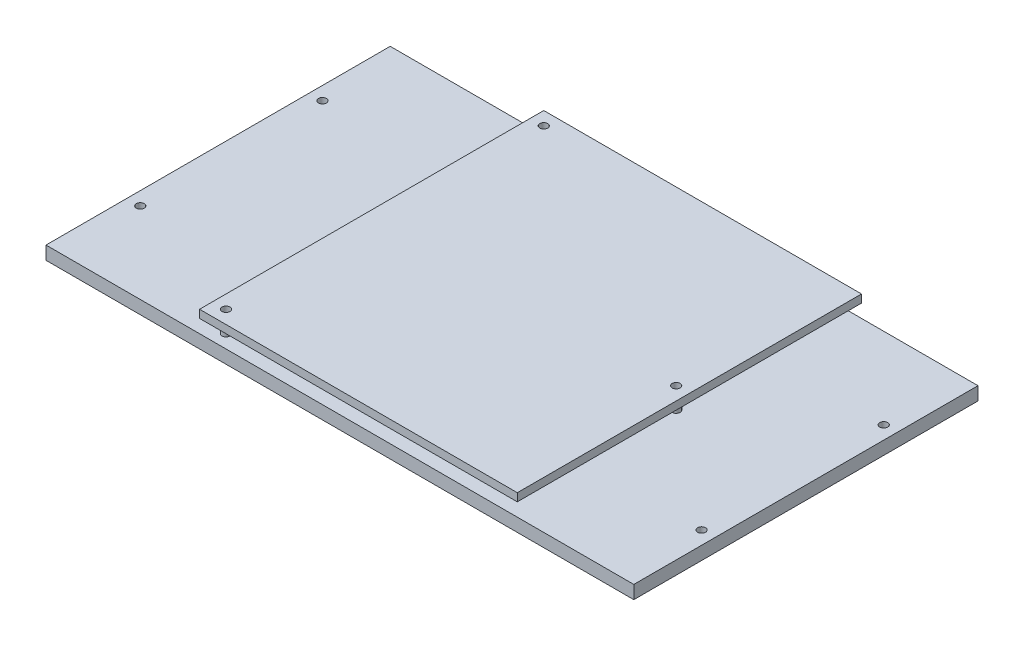
ISO-10303-21;
HEADER;
FILE_DESCRIPTION(('STEP AP214'),'2;1');
FILE_NAME('part.step','',(''),(''),'','','');
FILE_SCHEMA(('AUTOMOTIVE_DESIGN { 1 0 10303 214 1 1 1 1 }'));
ENDSEC;
DATA;
#1=APPLICATION_CONTEXT('core data for automotive mechanical design processes');
#2=APPLICATION_PROTOCOL_DEFINITION('international standard','automotive_design',2000,#1);
#3=PRODUCT_CONTEXT('',#1,'mechanical');
#4=PRODUCT('Part','Part','',(#3));
#5=PRODUCT_RELATED_PRODUCT_CATEGORY('part','',(#4));
#6=PRODUCT_DEFINITION_FORMATION('','',#4);
#7=PRODUCT_DEFINITION_CONTEXT('part definition',#1,'design');
#8=PRODUCT_DEFINITION('design','',#6,#7);
#9=PRODUCT_DEFINITION_SHAPE('','',#8);
#10=(LENGTH_UNIT() NAMED_UNIT(*) SI_UNIT(.MILLI.,.METRE.));
#11=(NAMED_UNIT(*) PLANE_ANGLE_UNIT() SI_UNIT($,.RADIAN.));
#12=(NAMED_UNIT(*) SI_UNIT($,.STERADIAN.) SOLID_ANGLE_UNIT());
#13=UNCERTAINTY_MEASURE_WITH_UNIT(LENGTH_MEASURE(1.E-05),#10,'distance_accuracy_value','');
#14=(GEOMETRIC_REPRESENTATION_CONTEXT(3) GLOBAL_UNCERTAINTY_ASSIGNED_CONTEXT((#13)) GLOBAL_UNIT_ASSIGNED_CONTEXT((#10,
#11,#12)) REPRESENTATION_CONTEXT('',''));
#15=CARTESIAN_POINT('',(0.,0.,0.));
#16=DIRECTION('',(0.,0.,1.));
#17=DIRECTION('',(1.,0.,0.));
#18=AXIS2_PLACEMENT_3D('',#15,#16,#17);
#19=CARTESIAN_POINT('',(-53.,13.,65.));
#20=DIRECTION('',(0.,1.,0.));
#21=DIRECTION('',(0.,0.,1.));
#22=AXIS2_PLACEMENT_3D('',#19,#20,#21);
#23=PLANE('',#22);
#24=CARTESIAN_POINT('',(62.,13.,0.));
#25=DIRECTION('',(0.,1.,0.));
#26=DIRECTION('',(0.,0.,1.));
#27=AXIS2_PLACEMENT_3D('',#24,#25,#26);
#28=CIRCLE('',#27,1.5);
#29=CARTESIAN_POINT('',(62.,13.,1.5));
#30=VERTEX_POINT('',#29);
#31=EDGE_CURVE('E124',#30,#30,#28,.T.);
#32=ORIENTED_EDGE('',*,*,#31,.F.);
#33=EDGE_LOOP('',(#32));
#34=FACE_BOUND('',#33,.T.);
#35=DIRECTION('',(0.,0.,1.));
#36=VECTOR('',#35,1.);
#37=CARTESIAN_POINT('',(-53.,13.,-65.));
#38=LINE('',#37,#36);
#39=CARTESIAN_POINT('',(-53.,13.,-65.));
#40=VERTEX_POINT('',#39);
#41=CARTESIAN_POINT('',(-53.,13.,65.));
#42=VERTEX_POINT('',#41);
#43=EDGE_CURVE('E94',#40,#42,#38,.T.);
#44=ORIENTED_EDGE('',*,*,#43,.T.);
#45=DIRECTION('',(1.,0.,0.));
#46=VECTOR('',#45,1.);
#47=CARTESIAN_POINT('',(-53.,13.,65.));
#48=LINE('',#47,#46);
#49=CARTESIAN_POINT('',(67.,13.,65.));
#50=VERTEX_POINT('',#49);
#51=EDGE_CURVE('E89',#42,#50,#48,.T.);
#52=ORIENTED_EDGE('',*,*,#51,.T.);
#53=DIRECTION('',(0.,0.,-1.));
#54=VECTOR('',#53,1.);
#55=CARTESIAN_POINT('',(67.,13.,-65.));
#56=LINE('',#55,#54);
#57=CARTESIAN_POINT('',(67.,13.,-65.));
#58=VERTEX_POINT('',#57);
#59=EDGE_CURVE('E92',#50,#58,#56,.T.);
#60=ORIENTED_EDGE('',*,*,#59,.T.);
#61=DIRECTION('',(-1.,0.,0.));
#62=VECTOR('',#61,1.);
#63=CARTESIAN_POINT('',(-53.,13.,-65.));
#64=LINE('',#63,#62);
#65=EDGE_CURVE('E59',#58,#40,#64,.T.);
#66=ORIENTED_EDGE('',*,*,#65,.T.);
#67=EDGE_LOOP('',(#44,#52,#60,#66));
#68=FACE_BOUND('',#67,.T.);
#69=CARTESIAN_POINT('',(-48.,13.,60.));
#70=DIRECTION('',(0.,1.,0.));
#71=DIRECTION('',(0.,0.,1.));
#72=AXIS2_PLACEMENT_3D('',#69,#70,#71);
#73=CIRCLE('',#72,1.5);
#74=CARTESIAN_POINT('',(-48.,13.,61.5));
#75=VERTEX_POINT('',#74);
#76=EDGE_CURVE('E109',#75,#75,#73,.T.);
#77=ORIENTED_EDGE('',*,*,#76,.F.);
#78=EDGE_LOOP('',(#77));
#79=FACE_BOUND('',#78,.T.);
#80=CARTESIAN_POINT('',(-48.,13.,-60.));
#81=DIRECTION('',(0.,1.,0.));
#82=DIRECTION('',(0.,0.,1.));
#83=AXIS2_PLACEMENT_3D('',#80,#81,#82);
#84=CIRCLE('',#83,1.5);
#85=CARTESIAN_POINT('',(-48.,13.,-58.5));
#86=VERTEX_POINT('',#85);
#87=EDGE_CURVE('E130',#86,#86,#84,.T.);
#88=ORIENTED_EDGE('',*,*,#87,.F.);
#89=EDGE_LOOP('',(#88));
#90=FACE_BOUND('',#89,.T.);
#91=ADVANCED_FACE('F42',(#34,#68,#79,#90),#23,.T.);
#92=CARTESIAN_POINT('',(-53.,10.,65.));
#93=DIRECTION('',(0.,1.,0.));
#94=DIRECTION('',(0.,0.,1.));
#95=AXIS2_PLACEMENT_3D('',#92,#93,#94);
#96=PLANE('',#95);
#97=CARTESIAN_POINT('',(62.,10.,0.));
#98=DIRECTION('',(0.,1.,0.));
#99=DIRECTION('',(0.,0.,1.));
#100=AXIS2_PLACEMENT_3D('',#97,#98,#99);
#101=CIRCLE('',#100,1.5);
#102=CARTESIAN_POINT('',(62.,10.,1.5));
#103=VERTEX_POINT('',#102);
#104=EDGE_CURVE('E127',#103,#103,#101,.T.);
#105=ORIENTED_EDGE('',*,*,#104,.T.);
#106=EDGE_LOOP('',(#105));
#107=FACE_BOUND('',#106,.T.);
#108=DIRECTION('',(0.,0.,1.));
#109=VECTOR('',#108,1.);
#110=CARTESIAN_POINT('',(-53.,10.,-65.));
#111=LINE('',#110,#109);
#112=CARTESIAN_POINT('',(-53.,10.,-65.));
#113=VERTEX_POINT('',#112);
#114=CARTESIAN_POINT('',(-53.,10.,65.));
#115=VERTEX_POINT('',#114);
#116=EDGE_CURVE('E106',#113,#115,#111,.T.);
#117=ORIENTED_EDGE('',*,*,#116,.F.);
#118=DIRECTION('',(-1.,0.,0.));
#119=VECTOR('',#118,1.);
#120=CARTESIAN_POINT('',(-53.,10.,-65.));
#121=LINE('',#120,#119);
#122=CARTESIAN_POINT('',(67.,10.,-65.));
#123=VERTEX_POINT('',#122);
#124=EDGE_CURVE('E82',#123,#113,#121,.T.);
#125=ORIENTED_EDGE('',*,*,#124,.F.);
#126=DIRECTION('',(0.,0.,-1.));
#127=VECTOR('',#126,1.);
#128=CARTESIAN_POINT('',(67.,10.,-65.));
#129=LINE('',#128,#127);
#130=CARTESIAN_POINT('',(67.,10.,65.));
#131=VERTEX_POINT('',#130);
#132=EDGE_CURVE('E76',#131,#123,#129,.T.);
#133=ORIENTED_EDGE('',*,*,#132,.F.);
#134=DIRECTION('',(1.,0.,0.));
#135=VECTOR('',#134,1.);
#136=CARTESIAN_POINT('',(-53.,10.,65.));
#137=LINE('',#136,#135);
#138=EDGE_CURVE('E98',#115,#131,#137,.T.);
#139=ORIENTED_EDGE('',*,*,#138,.F.);
#140=EDGE_LOOP('',(#117,#125,#133,#139));
#141=FACE_BOUND('',#140,.T.);
#142=CARTESIAN_POINT('',(-48.,10.,60.));
#143=DIRECTION('',(0.,1.,0.));
#144=DIRECTION('',(0.,0.,1.));
#145=AXIS2_PLACEMENT_3D('',#142,#143,#144);
#146=CIRCLE('',#145,1.5);
#147=CARTESIAN_POINT('',(-48.,10.,61.5));
#148=VERTEX_POINT('',#147);
#149=EDGE_CURVE('E121',#148,#148,#146,.T.);
#150=ORIENTED_EDGE('',*,*,#149,.T.);
#151=EDGE_LOOP('',(#150));
#152=FACE_BOUND('',#151,.T.);
#153=CARTESIAN_POINT('',(-48.,10.,-60.));
#154=DIRECTION('',(0.,1.,0.));
#155=DIRECTION('',(0.,0.,1.));
#156=AXIS2_PLACEMENT_3D('',#153,#154,#155);
#157=CIRCLE('',#156,1.5);
#158=CARTESIAN_POINT('',(-48.,10.,-58.5));
#159=VERTEX_POINT('',#158);
#160=EDGE_CURVE('E133',#159,#159,#157,.T.);
#161=ORIENTED_EDGE('',*,*,#160,.T.);
#162=EDGE_LOOP('',(#161));
#163=FACE_BOUND('',#162,.T.);
#164=ADVANCED_FACE('F117',(#107,#141,#152,#163),#96,.F.);
#165=CARTESIAN_POINT('',(-53.,13.,-65.));
#166=DIRECTION('',(1.,0.,0.));
#167=DIRECTION('',(0.,0.,-1.));
#168=AXIS2_PLACEMENT_3D('',#165,#166,#167);
#169=PLANE('',#168);
#170=ORIENTED_EDGE('',*,*,#116,.T.);
#171=DIRECTION('',(0.,-1.,0.));
#172=VECTOR('',#171,1.);
#173=CARTESIAN_POINT('',(-53.,13.,65.));
#174=LINE('',#173,#172);
#175=EDGE_CURVE('E12',#42,#115,#174,.T.);
#176=ORIENTED_EDGE('',*,*,#175,.F.);
#177=ORIENTED_EDGE('',*,*,#43,.F.);
#178=DIRECTION('',(0.,-1.,0.));
#179=VECTOR('',#178,1.);
#180=CARTESIAN_POINT('',(-53.,13.,-65.));
#181=LINE('',#180,#179);
#182=EDGE_CURVE('E102',#40,#113,#181,.T.);
#183=ORIENTED_EDGE('',*,*,#182,.T.);
#184=EDGE_LOOP('',(#170,#176,#177,#183));
#185=FACE_BOUND('',#184,.T.);
#186=ADVANCED_FACE('F44',(#185),#169,.F.);
#187=CARTESIAN_POINT('',(-53.,13.,65.));
#188=DIRECTION('',(0.,0.,-1.));
#189=DIRECTION('',(-1.,0.,0.));
#190=AXIS2_PLACEMENT_3D('',#187,#188,#189);
#191=PLANE('',#190);
#192=ORIENTED_EDGE('',*,*,#138,.T.);
#193=DIRECTION('',(0.,-1.,0.));
#194=VECTOR('',#193,1.);
#195=CARTESIAN_POINT('',(67.,13.,65.));
#196=LINE('',#195,#194);
#197=EDGE_CURVE('E51',#50,#131,#196,.T.);
#198=ORIENTED_EDGE('',*,*,#197,.F.);
#199=ORIENTED_EDGE('',*,*,#51,.F.);
#200=ORIENTED_EDGE('',*,*,#175,.T.);
#201=EDGE_LOOP('',(#192,#198,#199,#200));
#202=FACE_BOUND('',#201,.T.);
#203=ADVANCED_FACE('F97',(#202),#191,.F.);
#204=CARTESIAN_POINT('',(67.,13.,-65.));
#205=DIRECTION('',(-1.,0.,0.));
#206=DIRECTION('',(0.,0.,1.));
#207=AXIS2_PLACEMENT_3D('',#204,#205,#206);
#208=PLANE('',#207);
#209=ORIENTED_EDGE('',*,*,#132,.T.);
#210=DIRECTION('',(0.,-1.,0.));
#211=VECTOR('',#210,1.);
#212=CARTESIAN_POINT('',(67.,13.,-65.));
#213=LINE('',#212,#211);
#214=EDGE_CURVE('E99',#58,#123,#213,.T.);
#215=ORIENTED_EDGE('',*,*,#214,.F.);
#216=ORIENTED_EDGE('',*,*,#59,.F.);
#217=ORIENTED_EDGE('',*,*,#197,.T.);
#218=EDGE_LOOP('',(#209,#215,#216,#217));
#219=FACE_BOUND('',#218,.T.);
#220=ADVANCED_FACE('F100',(#219),#208,.F.);
#221=CARTESIAN_POINT('',(-53.,13.,-65.));
#222=DIRECTION('',(0.,0.,1.));
#223=DIRECTION('',(1.,0.,0.));
#224=AXIS2_PLACEMENT_3D('',#221,#222,#223);
#225=PLANE('',#224);
#226=ORIENTED_EDGE('',*,*,#124,.T.);
#227=ORIENTED_EDGE('',*,*,#182,.F.);
#228=ORIENTED_EDGE('',*,*,#65,.F.);
#229=ORIENTED_EDGE('',*,*,#214,.T.);
#230=EDGE_LOOP('',(#226,#227,#228,#229));
#231=FACE_BOUND('',#230,.T.);
#232=ADVANCED_FACE('F114',(#231),#225,.F.);
#233=CARTESIAN_POINT('',(-48.,13.,60.));
#234=DIRECTION('',(0.,-1.,0.));
#235=DIRECTION('',(0.,0.,-1.));
#236=AXIS2_PLACEMENT_3D('',#233,#234,#235);
#237=CYLINDRICAL_SURFACE('',#236,1.5);
#238=ORIENTED_EDGE('',*,*,#76,.T.);
#239=EDGE_LOOP('',(#238));
#240=FACE_BOUND('',#239,.T.);
#241=ORIENTED_EDGE('',*,*,#149,.F.);
#242=EDGE_LOOP('',(#241));
#243=FACE_BOUND('',#242,.T.);
#244=ADVANCED_FACE('F152',(#240,#243),#237,.F.);
#245=CARTESIAN_POINT('',(62.,13.,0.));
#246=DIRECTION('',(0.,-1.,0.));
#247=DIRECTION('',(0.,0.,-1.));
#248=AXIS2_PLACEMENT_3D('',#245,#246,#247);
#249=CYLINDRICAL_SURFACE('',#248,1.5);
#250=ORIENTED_EDGE('',*,*,#31,.T.);
#251=EDGE_LOOP('',(#250));
#252=FACE_BOUND('',#251,.T.);
#253=ORIENTED_EDGE('',*,*,#104,.F.);
#254=EDGE_LOOP('',(#253));
#255=FACE_BOUND('',#254,.T.);
#256=ADVANCED_FACE('F200',(#252,#255),#249,.F.);
#257=CARTESIAN_POINT('',(-48.,13.,-60.));
#258=DIRECTION('',(0.,-1.,0.));
#259=DIRECTION('',(0.,0.,-1.));
#260=AXIS2_PLACEMENT_3D('',#257,#258,#259);
#261=CYLINDRICAL_SURFACE('',#260,1.5);
#262=ORIENTED_EDGE('',*,*,#87,.T.);
#263=EDGE_LOOP('',(#262));
#264=FACE_BOUND('',#263,.T.);
#265=ORIENTED_EDGE('',*,*,#160,.F.);
#266=EDGE_LOOP('',(#265));
#267=FACE_BOUND('',#266,.T.);
#268=ADVANCED_FACE('F139',(#264,#267),#261,.F.);
#269=CLOSED_SHELL('',(#91,#164,#186,#203,#220,#232,#244,#256,#268));
#270=MANIFOLD_SOLID_BREP('B2',#269);
#271=CARTESIAN_POINT('',(111.,5.,65.));
#272=DIRECTION('',(0.,1.,0.));
#273=DIRECTION('',(0.,0.,1.));
#274=AXIS2_PLACEMENT_3D('',#271,#272,#273);
#275=PLANE('',#274);
#276=CARTESIAN_POINT('',(-48.,5.,60.));
#277=DIRECTION('',(0.,1.,0.));
#278=DIRECTION('',(0.,0.,1.));
#279=AXIS2_PLACEMENT_3D('',#276,#277,#278);
#280=CIRCLE('',#279,1.5);
#281=CARTESIAN_POINT('',(-48.,5.,61.5));
#282=VERTEX_POINT('',#281);
#283=EDGE_CURVE('E336',#282,#282,#280,.T.);
#284=ORIENTED_EDGE('',*,*,#283,.F.);
#285=EDGE_LOOP('',(#284));
#286=FACE_BOUND('',#285,.T.);
#287=CARTESIAN_POINT('',(106.,5.,34.4));
#288=DIRECTION('',(0.,1.,0.));
#289=DIRECTION('',(0.,0.,1.));
#290=AXIS2_PLACEMENT_3D('',#287,#288,#289);
#291=CIRCLE('',#290,1.5);
#292=CARTESIAN_POINT('',(106.,5.,35.9));
#293=VERTEX_POINT('',#292);
#294=EDGE_CURVE('E324',#293,#293,#291,.T.);
#295=ORIENTED_EDGE('',*,*,#294,.F.);
#296=EDGE_LOOP('',(#295));
#297=FACE_BOUND('',#296,.T.);
#298=CARTESIAN_POINT('',(-106.,5.,34.4));
#299=DIRECTION('',(0.,1.,0.));
#300=DIRECTION('',(0.,0.,1.));
#301=AXIS2_PLACEMENT_3D('',#298,#299,#300);
#302=CIRCLE('',#301,1.5);
#303=CARTESIAN_POINT('',(-106.,5.,35.9));
#304=VERTEX_POINT('',#303);
#305=EDGE_CURVE('E312',#304,#304,#302,.T.);
#306=ORIENTED_EDGE('',*,*,#305,.F.);
#307=EDGE_LOOP('',(#306));
#308=FACE_BOUND('',#307,.T.);
#309=DIRECTION('',(0.,0.,-1.));
#310=VECTOR('',#309,1.);
#311=CARTESIAN_POINT('',(111.,5.,-65.));
#312=LINE('',#311,#310);
#313=CARTESIAN_POINT('',(111.,5.,65.));
#314=VERTEX_POINT('',#313);
#315=CARTESIAN_POINT('',(111.,5.,-65.));
#316=VERTEX_POINT('',#315);
#317=EDGE_CURVE('E282',#314,#316,#312,.T.);
#318=ORIENTED_EDGE('',*,*,#317,.T.);
#319=DIRECTION('',(-1.,0.,0.));
#320=VECTOR('',#319,1.);
#321=CARTESIAN_POINT('',(-111.,5.,-65.));
#322=LINE('',#321,#320);
#323=CARTESIAN_POINT('',(-111.,5.,-65.));
#324=VERTEX_POINT('',#323);
#325=EDGE_CURVE('E277',#316,#324,#322,.T.);
#326=ORIENTED_EDGE('',*,*,#325,.T.);
#327=DIRECTION('',(0.,0.,1.));
#328=VECTOR('',#327,1.);
#329=CARTESIAN_POINT('',(-111.,5.,-65.));
#330=LINE('',#329,#328);
#331=CARTESIAN_POINT('',(-111.,5.,65.));
#332=VERTEX_POINT('',#331);
#333=EDGE_CURVE('E280',#324,#332,#330,.T.);
#334=ORIENTED_EDGE('',*,*,#333,.T.);
#335=DIRECTION('',(1.,0.,0.));
#336=VECTOR('',#335,1.);
#337=CARTESIAN_POINT('',(-111.,5.,65.));
#338=LINE('',#337,#336);
#339=EDGE_CURVE('E247',#332,#314,#338,.T.);
#340=ORIENTED_EDGE('',*,*,#339,.T.);
#341=EDGE_LOOP('',(#318,#326,#334,#340));
#342=FACE_BOUND('',#341,.T.);
#343=CARTESIAN_POINT('',(-106.,5.,-34.4));
#344=DIRECTION('',(0.,1.,0.));
#345=DIRECTION('',(0.,0.,1.));
#346=AXIS2_PLACEMENT_3D('',#343,#344,#345);
#347=CIRCLE('',#346,1.5);
#348=CARTESIAN_POINT('',(-106.,5.,-32.9));
#349=VERTEX_POINT('',#348);
#350=EDGE_CURVE('E297',#349,#349,#347,.T.);
#351=ORIENTED_EDGE('',*,*,#350,.F.);
#352=EDGE_LOOP('',(#351));
#353=FACE_BOUND('',#352,.T.);
#354=CARTESIAN_POINT('',(106.,5.,-34.4));
#355=DIRECTION('',(0.,1.,0.));
#356=DIRECTION('',(0.,0.,1.));
#357=AXIS2_PLACEMENT_3D('',#354,#355,#356);
#358=CIRCLE('',#357,1.5);
#359=CARTESIAN_POINT('',(106.,5.,-32.9));
#360=VERTEX_POINT('',#359);
#361=EDGE_CURVE('E318',#360,#360,#358,.T.);
#362=ORIENTED_EDGE('',*,*,#361,.F.);
#363=EDGE_LOOP('',(#362));
#364=FACE_BOUND('',#363,.T.);
#365=CARTESIAN_POINT('',(62.,5.,0.));
#366=DIRECTION('',(0.,1.,0.));
#367=DIRECTION('',(0.,0.,1.));
#368=AXIS2_PLACEMENT_3D('',#365,#366,#367);
#369=CIRCLE('',#368,1.5);
#370=CARTESIAN_POINT('',(62.,5.,1.5));
#371=VERTEX_POINT('',#370);
#372=EDGE_CURVE('E333',#371,#371,#369,.T.);
#373=ORIENTED_EDGE('',*,*,#372,.F.);
#374=EDGE_LOOP('',(#373));
#375=FACE_BOUND('',#374,.T.);
#376=CARTESIAN_POINT('',(-48.,5.,-60.));
#377=DIRECTION('',(0.,1.,0.));
#378=DIRECTION('',(0.,0.,1.));
#379=AXIS2_PLACEMENT_3D('',#376,#377,#378);
#380=CIRCLE('',#379,1.5);
#381=CARTESIAN_POINT('',(-48.,5.,-58.5));
#382=VERTEX_POINT('',#381);
#383=EDGE_CURVE('E342',#382,#382,#380,.T.);
#384=ORIENTED_EDGE('',*,*,#383,.F.);
#385=EDGE_LOOP('',(#384));
#386=FACE_BOUND('',#385,.T.);
#387=ADVANCED_FACE('F230',(#286,#297,#308,#342,#353,#364,#375,#386),#275,.T.);
#388=CARTESIAN_POINT('',(111.,0.,65.));
#389=DIRECTION('',(0.,1.,0.));
#390=DIRECTION('',(0.,0.,1.));
#391=AXIS2_PLACEMENT_3D('',#388,#389,#390);
#392=PLANE('',#391);
#393=CARTESIAN_POINT('',(106.,0.,-34.4));
#394=DIRECTION('',(0.,1.,0.));
#395=DIRECTION('',(0.,0.,1.));
#396=AXIS2_PLACEMENT_3D('',#393,#394,#395);
#397=CIRCLE('',#396,1.5);
#398=CARTESIAN_POINT('',(106.,0.,-32.9));
#399=VERTEX_POINT('',#398);
#400=EDGE_CURVE('E321',#399,#399,#397,.T.);
#401=ORIENTED_EDGE('',*,*,#400,.T.);
#402=EDGE_LOOP('',(#401));
#403=FACE_BOUND('',#402,.T.);
#404=CARTESIAN_POINT('',(-106.,0.,-34.4));
#405=DIRECTION('',(0.,1.,0.));
#406=DIRECTION('',(0.,0.,1.));
#407=AXIS2_PLACEMENT_3D('',#404,#405,#406);
#408=CIRCLE('',#407,1.5);
#409=CARTESIAN_POINT('',(-106.,0.,-32.9));
#410=VERTEX_POINT('',#409);
#411=EDGE_CURVE('E309',#410,#410,#408,.T.);
#412=ORIENTED_EDGE('',*,*,#411,.T.);
#413=EDGE_LOOP('',(#412));
#414=FACE_BOUND('',#413,.T.);
#415=DIRECTION('',(0.,0.,-1.));
#416=VECTOR('',#415,1.);
#417=CARTESIAN_POINT('',(111.,0.,-65.));
#418=LINE('',#417,#416);
#419=CARTESIAN_POINT('',(111.,0.,65.));
#420=VERTEX_POINT('',#419);
#421=CARTESIAN_POINT('',(111.,0.,-65.));
#422=VERTEX_POINT('',#421);
#423=EDGE_CURVE('E294',#420,#422,#418,.T.);
#424=ORIENTED_EDGE('',*,*,#423,.F.);
#425=DIRECTION('',(1.,0.,0.));
#426=VECTOR('',#425,1.);
#427=CARTESIAN_POINT('',(-111.,0.,65.));
#428=LINE('',#427,#426);
#429=CARTESIAN_POINT('',(-111.,0.,65.));
#430=VERTEX_POINT('',#429);
#431=EDGE_CURVE('E270',#430,#420,#428,.T.);
#432=ORIENTED_EDGE('',*,*,#431,.F.);
#433=DIRECTION('',(0.,0.,1.));
#434=VECTOR('',#433,1.);
#435=CARTESIAN_POINT('',(-111.,0.,-65.));
#436=LINE('',#435,#434);
#437=CARTESIAN_POINT('',(-111.,0.,-65.));
#438=VERTEX_POINT('',#437);
#439=EDGE_CURVE('E264',#438,#430,#436,.T.);
#440=ORIENTED_EDGE('',*,*,#439,.F.);
#441=DIRECTION('',(-1.,0.,0.));
#442=VECTOR('',#441,1.);
#443=CARTESIAN_POINT('',(-111.,0.,-65.));
#444=LINE('',#443,#442);
#445=EDGE_CURVE('E286',#422,#438,#444,.T.);
#446=ORIENTED_EDGE('',*,*,#445,.F.);
#447=EDGE_LOOP('',(#424,#432,#440,#446));
#448=FACE_BOUND('',#447,.T.);
#449=CARTESIAN_POINT('',(-106.,0.,34.4));
#450=DIRECTION('',(0.,1.,0.));
#451=DIRECTION('',(0.,0.,1.));
#452=AXIS2_PLACEMENT_3D('',#449,#450,#451);
#453=CIRCLE('',#452,1.5);
#454=CARTESIAN_POINT('',(-106.,0.,35.9));
#455=VERTEX_POINT('',#454);
#456=EDGE_CURVE('E315',#455,#455,#453,.T.);
#457=ORIENTED_EDGE('',*,*,#456,.T.);
#458=EDGE_LOOP('',(#457));
#459=FACE_BOUND('',#458,.T.);
#460=CARTESIAN_POINT('',(106.,0.,34.4));
#461=DIRECTION('',(0.,1.,0.));
#462=DIRECTION('',(0.,0.,1.));
#463=AXIS2_PLACEMENT_3D('',#460,#461,#462);
#464=CIRCLE('',#463,1.5);
#465=CARTESIAN_POINT('',(106.,0.,35.9));
#466=VERTEX_POINT('',#465);
#467=EDGE_CURVE('E327',#466,#466,#464,.T.);
#468=ORIENTED_EDGE('',*,*,#467,.T.);
#469=EDGE_LOOP('',(#468));
#470=FACE_BOUND('',#469,.T.);
#471=ADVANCED_FACE('F305',(#403,#414,#448,#459,#470),#392,.F.);
#472=CARTESIAN_POINT('',(111.,5.,-65.));
#473=DIRECTION('',(-1.,0.,0.));
#474=DIRECTION('',(0.,0.,1.));
#475=AXIS2_PLACEMENT_3D('',#472,#473,#474);
#476=PLANE('',#475);
#477=ORIENTED_EDGE('',*,*,#423,.T.);
#478=DIRECTION('',(0.,-1.,0.));
#479=VECTOR('',#478,1.);
#480=CARTESIAN_POINT('',(111.,5.,-65.));
#481=LINE('',#480,#479);
#482=EDGE_CURVE('E40',#316,#422,#481,.T.);
#483=ORIENTED_EDGE('',*,*,#482,.F.);
#484=ORIENTED_EDGE('',*,*,#317,.F.);
#485=DIRECTION('',(0.,-1.,0.));
#486=VECTOR('',#485,1.);
#487=CARTESIAN_POINT('',(111.,5.,65.));
#488=LINE('',#487,#486);
#489=EDGE_CURVE('E290',#314,#420,#488,.T.);
#490=ORIENTED_EDGE('',*,*,#489,.T.);
#491=EDGE_LOOP('',(#477,#483,#484,#490));
#492=FACE_BOUND('',#491,.T.);
#493=ADVANCED_FACE('F232',(#492),#476,.F.);
#494=CARTESIAN_POINT('',(-111.,5.,-65.));
#495=DIRECTION('',(0.,0.,1.));
#496=DIRECTION('',(1.,0.,0.));
#497=AXIS2_PLACEMENT_3D('',#494,#495,#496);
#498=PLANE('',#497);
#499=ORIENTED_EDGE('',*,*,#445,.T.);
#500=DIRECTION('',(0.,-1.,0.));
#501=VECTOR('',#500,1.);
#502=CARTESIAN_POINT('',(-111.,5.,-65.));
#503=LINE('',#502,#501);
#504=EDGE_CURVE('E239',#324,#438,#503,.T.);
#505=ORIENTED_EDGE('',*,*,#504,.F.);
#506=ORIENTED_EDGE('',*,*,#325,.F.);
#507=ORIENTED_EDGE('',*,*,#482,.T.);
#508=EDGE_LOOP('',(#499,#505,#506,#507));
#509=FACE_BOUND('',#508,.T.);
#510=ADVANCED_FACE('F285',(#509),#498,.F.);
#511=CARTESIAN_POINT('',(-111.,5.,-65.));
#512=DIRECTION('',(1.,0.,0.));
#513=DIRECTION('',(0.,0.,-1.));
#514=AXIS2_PLACEMENT_3D('',#511,#512,#513);
#515=PLANE('',#514);
#516=ORIENTED_EDGE('',*,*,#439,.T.);
#517=DIRECTION('',(0.,-1.,0.));
#518=VECTOR('',#517,1.);
#519=CARTESIAN_POINT('',(-111.,5.,65.));
#520=LINE('',#519,#518);
#521=EDGE_CURVE('E287',#332,#430,#520,.T.);
#522=ORIENTED_EDGE('',*,*,#521,.F.);
#523=ORIENTED_EDGE('',*,*,#333,.F.);
#524=ORIENTED_EDGE('',*,*,#504,.T.);
#525=EDGE_LOOP('',(#516,#522,#523,#524));
#526=FACE_BOUND('',#525,.T.);
#527=ADVANCED_FACE('F288',(#526),#515,.F.);
#528=CARTESIAN_POINT('',(-111.,5.,65.));
#529=DIRECTION('',(0.,0.,-1.));
#530=DIRECTION('',(-1.,0.,0.));
#531=AXIS2_PLACEMENT_3D('',#528,#529,#530);
#532=PLANE('',#531);
#533=ORIENTED_EDGE('',*,*,#431,.T.);
#534=ORIENTED_EDGE('',*,*,#489,.F.);
#535=ORIENTED_EDGE('',*,*,#339,.F.);
#536=ORIENTED_EDGE('',*,*,#521,.T.);
#537=EDGE_LOOP('',(#533,#534,#535,#536));
#538=FACE_BOUND('',#537,.T.);
#539=ADVANCED_FACE('F302',(#538),#532,.F.);
#540=CARTESIAN_POINT('',(-106.,5.,-34.4));
#541=DIRECTION('',(0.,-1.,0.));
#542=DIRECTION('',(0.,0.,-1.));
#543=AXIS2_PLACEMENT_3D('',#540,#541,#542);
#544=CYLINDRICAL_SURFACE('',#543,1.5);
#545=ORIENTED_EDGE('',*,*,#350,.T.);
#546=EDGE_LOOP('',(#545));
#547=FACE_BOUND('',#546,.T.);
#548=ORIENTED_EDGE('',*,*,#411,.F.);
#549=EDGE_LOOP('',(#548));
#550=FACE_BOUND('',#549,.T.);
#551=ADVANCED_FACE('F364',(#547,#550),#544,.F.);
#552=CARTESIAN_POINT('',(-106.,5.,34.4));
#553=DIRECTION('',(0.,-1.,0.));
#554=DIRECTION('',(0.,0.,-1.));
#555=AXIS2_PLACEMENT_3D('',#552,#553,#554);
#556=CYLINDRICAL_SURFACE('',#555,1.5);
#557=ORIENTED_EDGE('',*,*,#305,.T.);
#558=EDGE_LOOP('',(#557));
#559=FACE_BOUND('',#558,.T.);
#560=ORIENTED_EDGE('',*,*,#456,.F.);
#561=EDGE_LOOP('',(#560));
#562=FACE_BOUND('',#561,.T.);
#563=ADVANCED_FACE('F406',(#559,#562),#556,.F.);
#564=CARTESIAN_POINT('',(106.,5.,-34.4));
#565=DIRECTION('',(0.,-1.,0.));
#566=DIRECTION('',(0.,0.,-1.));
#567=AXIS2_PLACEMENT_3D('',#564,#565,#566);
#568=CYLINDRICAL_SURFACE('',#567,1.5);
#569=ORIENTED_EDGE('',*,*,#361,.T.);
#570=EDGE_LOOP('',(#569));
#571=FACE_BOUND('',#570,.T.);
#572=ORIENTED_EDGE('',*,*,#400,.F.);
#573=EDGE_LOOP('',(#572));
#574=FACE_BOUND('',#573,.T.);
#575=ADVANCED_FACE('F414',(#571,#574),#568,.F.);
#576=CARTESIAN_POINT('',(106.,5.,34.4));
#577=DIRECTION('',(0.,-1.,0.));
#578=DIRECTION('',(0.,0.,-1.));
#579=AXIS2_PLACEMENT_3D('',#576,#577,#578);
#580=CYLINDRICAL_SURFACE('',#579,1.5);
#581=ORIENTED_EDGE('',*,*,#294,.T.);
#582=EDGE_LOOP('',(#581));
#583=FACE_BOUND('',#582,.T.);
#584=ORIENTED_EDGE('',*,*,#467,.F.);
#585=EDGE_LOOP('',(#584));
#586=FACE_BOUND('',#585,.T.);
#587=ADVANCED_FACE('F422',(#583,#586),#580,.F.);
#588=CARTESIAN_POINT('',(62.,10.,0.));
#589=DIRECTION('',(0.,-1.,0.));
#590=DIRECTION('',(0.,0.,-1.));
#591=AXIS2_PLACEMENT_3D('',#588,#589,#590);
#592=CYLINDRICAL_SURFACE('',#591,1.5);
#593=CARTESIAN_POINT('',(62.,10.,0.));
#594=DIRECTION('',(0.,1.,0.));
#595=DIRECTION('',(0.,0.,1.));
#596=AXIS2_PLACEMENT_3D('',#593,#594,#595);
#597=CIRCLE('',#596,1.5);
#598=CARTESIAN_POINT('',(62.,10.,1.5));
#599=VERTEX_POINT('',#598);
#600=EDGE_CURVE('E330',#599,#599,#597,.T.);
#601=ORIENTED_EDGE('',*,*,#600,.F.);
#602=EDGE_LOOP('',(#601));
#603=FACE_BOUND('',#602,.T.);
#604=ORIENTED_EDGE('',*,*,#372,.T.);
#605=EDGE_LOOP('',(#604));
#606=FACE_BOUND('',#605,.T.);
#607=ADVANCED_FACE('F431',(#603,#606),#592,.T.);
#608=CARTESIAN_POINT('',(-200.244694692782,10.,0.));
#609=DIRECTION('',(0.,1.,0.));
#610=DIRECTION('',(0.,0.,1.));
#611=AXIS2_PLACEMENT_3D('',#608,#609,#610);
#612=PLANE('',#611);
#613=ORIENTED_EDGE('',*,*,#600,.T.);
#614=EDGE_LOOP('',(#613));
#615=FACE_BOUND('',#614,.T.);
#616=ADVANCED_FACE('F444',(#615),#612,.T.);
#617=CARTESIAN_POINT('',(-48.,10.,60.));
#618=DIRECTION('',(0.,-1.,0.));
#619=DIRECTION('',(0.,0.,-1.));
#620=AXIS2_PLACEMENT_3D('',#617,#618,#619);
#621=CYLINDRICAL_SURFACE('',#620,1.5);
#622=CARTESIAN_POINT('',(-48.,10.,60.));
#623=DIRECTION('',(0.,1.,0.));
#624=DIRECTION('',(0.,0.,1.));
#625=AXIS2_PLACEMENT_3D('',#622,#623,#624);
#626=CIRCLE('',#625,1.5);
#627=CARTESIAN_POINT('',(-48.,10.,61.5));
#628=VERTEX_POINT('',#627);
#629=EDGE_CURVE('E339',#628,#628,#626,.T.);
#630=ORIENTED_EDGE('',*,*,#629,.F.);
#631=EDGE_LOOP('',(#630));
#632=FACE_BOUND('',#631,.T.);
#633=ORIENTED_EDGE('',*,*,#283,.T.);
#634=EDGE_LOOP('',(#633));
#635=FACE_BOUND('',#634,.T.);
#636=ADVANCED_FACE('F453',(#632,#635),#621,.T.);
#637=CARTESIAN_POINT('',(-200.244694692782,10.,0.));
#638=DIRECTION('',(0.,1.,0.));
#639=DIRECTION('',(0.,0.,1.));
#640=AXIS2_PLACEMENT_3D('',#637,#638,#639);
#641=PLANE('',#640);
#642=ORIENTED_EDGE('',*,*,#629,.T.);
#643=EDGE_LOOP('',(#642));
#644=FACE_BOUND('',#643,.T.);
#645=ADVANCED_FACE('F462',(#644),#641,.T.);
#646=CARTESIAN_POINT('',(-48.,10.,-60.));
#647=DIRECTION('',(0.,-1.,0.));
#648=DIRECTION('',(0.,0.,-1.));
#649=AXIS2_PLACEMENT_3D('',#646,#647,#648);
#650=CYLINDRICAL_SURFACE('',#649,1.5);
#651=CARTESIAN_POINT('',(-48.,10.,-60.));
#652=DIRECTION('',(0.,1.,0.));
#653=DIRECTION('',(0.,0.,1.));
#654=AXIS2_PLACEMENT_3D('',#651,#652,#653);
#655=CIRCLE('',#654,1.5);
#656=CARTESIAN_POINT('',(-48.,10.,-58.5));
#657=VERTEX_POINT('',#656);
#658=EDGE_CURVE('E345',#657,#657,#655,.T.);
#659=ORIENTED_EDGE('',*,*,#658,.F.);
#660=EDGE_LOOP('',(#659));
#661=FACE_BOUND('',#660,.T.);
#662=ORIENTED_EDGE('',*,*,#383,.T.);
#663=EDGE_LOOP('',(#662));
#664=FACE_BOUND('',#663,.T.);
#665=ADVANCED_FACE('F351',(#661,#664),#650,.T.);
#666=CARTESIAN_POINT('',(-48.,10.,-60.));
#667=DIRECTION('',(0.,1.,0.));
#668=DIRECTION('',(0.,0.,1.));
#669=AXIS2_PLACEMENT_3D('',#666,#667,#668);
#670=PLANE('',#669);
#671=ORIENTED_EDGE('',*,*,#658,.T.);
#672=EDGE_LOOP('',(#671));
#673=FACE_BOUND('',#672,.T.);
#674=ADVANCED_FACE('F479',(#673),#670,.T.);
#675=CLOSED_SHELL('',(#387,#471,#493,#510,#527,#539,#551,#563,#575,#587,#607,#616,#636,#645,
#665,#674));
#676=MANIFOLD_SOLID_BREP('B6',#675);
#677=ADVANCED_BREP_SHAPE_REPRESENTATION('',(#18,#270,#676),#14);
#678=SHAPE_DEFINITION_REPRESENTATION(#9,#677);
ENDSEC;
END-ISO-10303-21;
